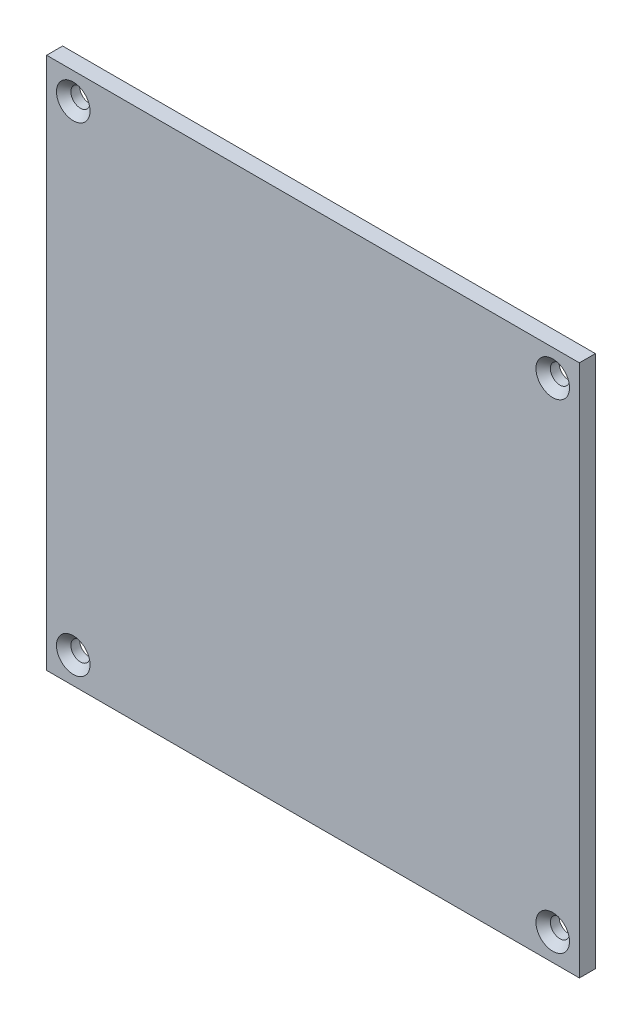
ISO-10303-21;
HEADER;
FILE_DESCRIPTION(('STEP AP214'),'2;1');
FILE_NAME('part.step','',(''),(''),'','','');
FILE_SCHEMA(('AUTOMOTIVE_DESIGN { 1 0 10303 214 1 1 1 1 }'));
ENDSEC;
DATA;
#1=APPLICATION_CONTEXT('core data for automotive mechanical design processes');
#2=APPLICATION_PROTOCOL_DEFINITION('international standard','automotive_design',2000,#1);
#3=PRODUCT_CONTEXT('',#1,'mechanical');
#4=PRODUCT('Part','Part','',(#3));
#5=PRODUCT_RELATED_PRODUCT_CATEGORY('part','',(#4));
#6=PRODUCT_DEFINITION_FORMATION('','',#4);
#7=PRODUCT_DEFINITION_CONTEXT('part definition',#1,'design');
#8=PRODUCT_DEFINITION('design','',#6,#7);
#9=PRODUCT_DEFINITION_SHAPE('','',#8);
#10=(LENGTH_UNIT() NAMED_UNIT(*) SI_UNIT(.MILLI.,.METRE.));
#11=(NAMED_UNIT(*) PLANE_ANGLE_UNIT() SI_UNIT($,.RADIAN.));
#12=(NAMED_UNIT(*) SI_UNIT($,.STERADIAN.) SOLID_ANGLE_UNIT());
#13=UNCERTAINTY_MEASURE_WITH_UNIT(LENGTH_MEASURE(1.E-05),#10,'distance_accuracy_value','');
#14=(GEOMETRIC_REPRESENTATION_CONTEXT(3) GLOBAL_UNCERTAINTY_ASSIGNED_CONTEXT((#13)) GLOBAL_UNIT_ASSIGNED_CONTEXT((#10,
#11,#12)) REPRESENTATION_CONTEXT('',''));
#15=CARTESIAN_POINT('',(0.,0.,0.));
#16=DIRECTION('',(0.,0.,1.));
#17=DIRECTION('',(1.,0.,0.));
#18=AXIS2_PLACEMENT_3D('',#15,#16,#17);
#19=CARTESIAN_POINT('',(0.,0.,3.));
#20=DIRECTION('',(1.,0.,0.));
#21=DIRECTION('',(0.,1.,0.));
#22=AXIS2_PLACEMENT_3D('',#19,#20,#21);
#23=PLANE('',#22);
#24=DIRECTION('',(0.,-1.,0.));
#25=VECTOR('',#24,1.);
#26=CARTESIAN_POINT('',(0.,0.,0.));
#27=LINE('',#26,#25);
#28=CARTESIAN_POINT('',(0.,100.,0.));
#29=VERTEX_POINT('',#28);
#30=CARTESIAN_POINT('',(0.,0.,0.));
#31=VERTEX_POINT('',#30);
#32=EDGE_CURVE('E98',#29,#31,#27,.T.);
#33=ORIENTED_EDGE('',*,*,#32,.T.);
#34=DIRECTION('',(0.,0.,-1.));
#35=VECTOR('',#34,1.);
#36=CARTESIAN_POINT('',(0.,0.,3.));
#37=LINE('',#36,#35);
#38=CARTESIAN_POINT('',(0.,0.,3.));
#39=VERTEX_POINT('',#38);
#40=EDGE_CURVE('E11',#39,#31,#37,.T.);
#41=ORIENTED_EDGE('',*,*,#40,.F.);
#42=DIRECTION('',(0.,-1.,0.));
#43=VECTOR('',#42,1.);
#44=CARTESIAN_POINT('',(0.,0.,3.));
#45=LINE('',#44,#43);
#46=CARTESIAN_POINT('',(0.,100.,3.));
#47=VERTEX_POINT('',#46);
#48=EDGE_CURVE('E86',#47,#39,#45,.T.);
#49=ORIENTED_EDGE('',*,*,#48,.F.);
#50=DIRECTION('',(0.,0.,-1.));
#51=VECTOR('',#50,1.);
#52=CARTESIAN_POINT('',(0.,100.,3.));
#53=LINE('',#52,#51);
#54=EDGE_CURVE('E94',#47,#29,#53,.T.);
#55=ORIENTED_EDGE('',*,*,#54,.T.);
#56=EDGE_LOOP('',(#33,#41,#49,#55));
#57=FACE_BOUND('',#56,.T.);
#58=ADVANCED_FACE('F35',(#57),#23,.F.);
#59=CARTESIAN_POINT('',(0.,0.,3.));
#60=DIRECTION('',(0.,1.,0.));
#61=DIRECTION('',(0.,0.,1.));
#62=AXIS2_PLACEMENT_3D('',#59,#60,#61);
#63=PLANE('',#62);
#64=DIRECTION('',(1.,0.,0.));
#65=VECTOR('',#64,1.);
#66=CARTESIAN_POINT('',(0.,0.,0.));
#67=LINE('',#66,#65);
#68=CARTESIAN_POINT('',(100.,0.,0.));
#69=VERTEX_POINT('',#68);
#70=EDGE_CURVE('E90',#31,#69,#67,.T.);
#71=ORIENTED_EDGE('',*,*,#70,.T.);
#72=DIRECTION('',(0.,0.,-1.));
#73=VECTOR('',#72,1.);
#74=CARTESIAN_POINT('',(100.,0.,3.));
#75=LINE('',#74,#73);
#76=CARTESIAN_POINT('',(100.,0.,3.));
#77=VERTEX_POINT('',#76);
#78=EDGE_CURVE('E43',#77,#69,#75,.T.);
#79=ORIENTED_EDGE('',*,*,#78,.F.);
#80=DIRECTION('',(1.,0.,0.));
#81=VECTOR('',#80,1.);
#82=CARTESIAN_POINT('',(0.,0.,3.));
#83=LINE('',#82,#81);
#84=EDGE_CURVE('E81',#39,#77,#83,.T.);
#85=ORIENTED_EDGE('',*,*,#84,.F.);
#86=ORIENTED_EDGE('',*,*,#40,.T.);
#87=EDGE_LOOP('',(#71,#79,#85,#86));
#88=FACE_BOUND('',#87,.T.);
#89=ADVANCED_FACE('F89',(#88),#63,.F.);
#90=CARTESIAN_POINT('',(100.,0.,3.));
#91=DIRECTION('',(-1.,0.,0.));
#92=DIRECTION('',(0.,-1.,0.));
#93=AXIS2_PLACEMENT_3D('',#90,#91,#92);
#94=PLANE('',#93);
#95=DIRECTION('',(0.,1.,0.));
#96=VECTOR('',#95,1.);
#97=CARTESIAN_POINT('',(100.,0.,0.));
#98=LINE('',#97,#96);
#99=CARTESIAN_POINT('',(100.,100.,0.));
#100=VERTEX_POINT('',#99);
#101=EDGE_CURVE('E68',#69,#100,#98,.T.);
#102=ORIENTED_EDGE('',*,*,#101,.T.);
#103=DIRECTION('',(0.,0.,-1.));
#104=VECTOR('',#103,1.);
#105=CARTESIAN_POINT('',(100.,100.,3.));
#106=LINE('',#105,#104);
#107=CARTESIAN_POINT('',(100.,100.,3.));
#108=VERTEX_POINT('',#107);
#109=EDGE_CURVE('E91',#108,#100,#106,.T.);
#110=ORIENTED_EDGE('',*,*,#109,.F.);
#111=DIRECTION('',(0.,1.,0.));
#112=VECTOR('',#111,1.);
#113=CARTESIAN_POINT('',(100.,0.,3.));
#114=LINE('',#113,#112);
#115=EDGE_CURVE('E84',#77,#108,#114,.T.);
#116=ORIENTED_EDGE('',*,*,#115,.F.);
#117=ORIENTED_EDGE('',*,*,#78,.T.);
#118=EDGE_LOOP('',(#102,#110,#116,#117));
#119=FACE_BOUND('',#118,.T.);
#120=ADVANCED_FACE('F92',(#119),#94,.F.);
#121=CARTESIAN_POINT('',(0.,100.,3.));
#122=DIRECTION('',(0.,-1.,0.));
#123=DIRECTION('',(0.,0.,-1.));
#124=AXIS2_PLACEMENT_3D('',#121,#122,#123);
#125=PLANE('',#124);
#126=DIRECTION('',(-1.,0.,0.));
#127=VECTOR('',#126,1.);
#128=CARTESIAN_POINT('',(0.,100.,0.));
#129=LINE('',#128,#127);
#130=EDGE_CURVE('E74',#100,#29,#129,.T.);
#131=ORIENTED_EDGE('',*,*,#130,.T.);
#132=ORIENTED_EDGE('',*,*,#54,.F.);
#133=DIRECTION('',(-1.,0.,0.));
#134=VECTOR('',#133,1.);
#135=CARTESIAN_POINT('',(0.,100.,3.));
#136=LINE('',#135,#134);
#137=EDGE_CURVE('E51',#108,#47,#136,.T.);
#138=ORIENTED_EDGE('',*,*,#137,.F.);
#139=ORIENTED_EDGE('',*,*,#109,.T.);
#140=EDGE_LOOP('',(#131,#132,#138,#139));
#141=FACE_BOUND('',#140,.T.);
#142=ADVANCED_FACE('F106',(#141),#125,.F.);
#143=CARTESIAN_POINT('',(0.,0.,3.));
#144=DIRECTION('',(0.,0.,-1.));
#145=DIRECTION('',(-1.,0.,0.));
#146=AXIS2_PLACEMENT_3D('',#143,#144,#145);
#147=PLANE('',#146);
#148=CARTESIAN_POINT('',(4.99999999999999,95.,3.));
#149=DIRECTION('',(0.,0.,1.));
#150=DIRECTION('',(1.,0.,0.));
#151=AXIS2_PLACEMENT_3D('',#148,#149,#150);
#152=CIRCLE('',#151,3.15);
#153=CARTESIAN_POINT('',(8.14999999999999,95.,3.));
#154=VERTEX_POINT('',#153);
#155=EDGE_CURVE('E144',#154,#154,#152,.T.);
#156=ORIENTED_EDGE('',*,*,#155,.F.);
#157=EDGE_LOOP('',(#156));
#158=FACE_BOUND('',#157,.T.);
#159=CARTESIAN_POINT('',(95.,95.,3.));
#160=DIRECTION('',(0.,0.,1.));
#161=DIRECTION('',(1.,0.,0.));
#162=AXIS2_PLACEMENT_3D('',#159,#160,#161);
#163=CIRCLE('',#162,3.15);
#164=CARTESIAN_POINT('',(98.15,95.,3.));
#165=VERTEX_POINT('',#164);
#166=EDGE_CURVE('E135',#165,#165,#163,.T.);
#167=ORIENTED_EDGE('',*,*,#166,.F.);
#168=EDGE_LOOP('',(#167));
#169=FACE_BOUND('',#168,.T.);
#170=CARTESIAN_POINT('',(95.,5.,3.));
#171=DIRECTION('',(0.,0.,1.));
#172=DIRECTION('',(1.,0.,0.));
#173=AXIS2_PLACEMENT_3D('',#170,#171,#172);
#174=CIRCLE('',#173,3.15);
#175=CARTESIAN_POINT('',(98.15,5.,3.));
#176=VERTEX_POINT('',#175);
#177=EDGE_CURVE('E126',#176,#176,#174,.T.);
#178=ORIENTED_EDGE('',*,*,#177,.F.);
#179=EDGE_LOOP('',(#178));
#180=FACE_BOUND('',#179,.T.);
#181=CARTESIAN_POINT('',(4.99999999999999,5.,3.));
#182=DIRECTION('',(0.,0.,1.));
#183=DIRECTION('',(1.,0.,0.));
#184=AXIS2_PLACEMENT_3D('',#181,#182,#183);
#185=CIRCLE('',#184,3.15);
#186=CARTESIAN_POINT('',(8.14999999999999,5.,3.));
#187=VERTEX_POINT('',#186);
#188=EDGE_CURVE('E117',#187,#187,#185,.T.);
#189=ORIENTED_EDGE('',*,*,#188,.F.);
#190=EDGE_LOOP('',(#189));
#191=FACE_BOUND('',#190,.T.);
#192=ORIENTED_EDGE('',*,*,#48,.T.);
#193=ORIENTED_EDGE('',*,*,#84,.T.);
#194=ORIENTED_EDGE('',*,*,#115,.T.);
#195=ORIENTED_EDGE('',*,*,#137,.T.);
#196=EDGE_LOOP('',(#192,#193,#194,#195));
#197=FACE_BOUND('',#196,.T.);
#198=ADVANCED_FACE('F82',(#158,#169,#180,#191,#197),#147,.F.);
#199=CARTESIAN_POINT('',(0.,0.,0.));
#200=DIRECTION('',(0.,0.,-1.));
#201=DIRECTION('',(-1.,0.,0.));
#202=AXIS2_PLACEMENT_3D('',#199,#200,#201);
#203=PLANE('',#202);
#204=CARTESIAN_POINT('',(4.99999999999999,95.,0.));
#205=DIRECTION('',(0.,0.,1.));
#206=DIRECTION('',(1.,0.,0.));
#207=AXIS2_PLACEMENT_3D('',#204,#205,#206);
#208=CIRCLE('',#207,1.8);
#209=CARTESIAN_POINT('',(6.79999999999999,95.,0.));
#210=VERTEX_POINT('',#209);
#211=EDGE_CURVE('E138',#210,#210,#208,.T.);
#212=ORIENTED_EDGE('',*,*,#211,.T.);
#213=EDGE_LOOP('',(#212));
#214=FACE_BOUND('',#213,.T.);
#215=CARTESIAN_POINT('',(95.,95.,0.));
#216=DIRECTION('',(0.,0.,1.));
#217=DIRECTION('',(1.,0.,0.));
#218=AXIS2_PLACEMENT_3D('',#215,#216,#217);
#219=CIRCLE('',#218,1.8);
#220=CARTESIAN_POINT('',(96.8,95.,0.));
#221=VERTEX_POINT('',#220);
#222=EDGE_CURVE('E129',#221,#221,#219,.T.);
#223=ORIENTED_EDGE('',*,*,#222,.T.);
#224=EDGE_LOOP('',(#223));
#225=FACE_BOUND('',#224,.T.);
#226=CARTESIAN_POINT('',(95.,5.,0.));
#227=DIRECTION('',(0.,0.,1.));
#228=DIRECTION('',(1.,0.,0.));
#229=AXIS2_PLACEMENT_3D('',#226,#227,#228);
#230=CIRCLE('',#229,1.8);
#231=CARTESIAN_POINT('',(96.8,5.,0.));
#232=VERTEX_POINT('',#231);
#233=EDGE_CURVE('E120',#232,#232,#230,.T.);
#234=ORIENTED_EDGE('',*,*,#233,.T.);
#235=EDGE_LOOP('',(#234));
#236=FACE_BOUND('',#235,.T.);
#237=CARTESIAN_POINT('',(4.99999999999999,5.,0.));
#238=DIRECTION('',(0.,0.,1.));
#239=DIRECTION('',(1.,0.,0.));
#240=AXIS2_PLACEMENT_3D('',#237,#238,#239);
#241=CIRCLE('',#240,1.8);
#242=CARTESIAN_POINT('',(6.79999999999999,5.,0.));
#243=VERTEX_POINT('',#242);
#244=EDGE_CURVE('E101',#243,#243,#241,.T.);
#245=ORIENTED_EDGE('',*,*,#244,.T.);
#246=EDGE_LOOP('',(#245));
#247=FACE_BOUND('',#246,.T.);
#248=ORIENTED_EDGE('',*,*,#32,.F.);
#249=ORIENTED_EDGE('',*,*,#130,.F.);
#250=ORIENTED_EDGE('',*,*,#101,.F.);
#251=ORIENTED_EDGE('',*,*,#70,.F.);
#252=EDGE_LOOP('',(#248,#249,#250,#251));
#253=FACE_BOUND('',#252,.T.);
#254=ADVANCED_FACE('F109',(#214,#225,#236,#247,#253),#203,.T.);
#255=CARTESIAN_POINT('',(4.99999999999999,5.,3.));
#256=DIRECTION('',(0.,0.,1.));
#257=DIRECTION('',(1.,0.,0.));
#258=AXIS2_PLACEMENT_3D('',#255,#256,#257);
#259=CYLINDRICAL_SURFACE('',#258,1.8);
#260=ORIENTED_EDGE('',*,*,#244,.F.);
#261=EDGE_LOOP('',(#260));
#262=FACE_BOUND('',#261,.T.);
#263=CARTESIAN_POINT('',(4.99999999999999,5.,1.65));
#264=DIRECTION('',(0.,0.,1.));
#265=DIRECTION('',(1.,0.,0.));
#266=AXIS2_PLACEMENT_3D('',#263,#264,#265);
#267=CIRCLE('',#266,1.8);
#268=CARTESIAN_POINT('',(6.79999999999999,5.,1.65));
#269=VERTEX_POINT('',#268);
#270=EDGE_CURVE('E114',#269,#269,#267,.T.);
#271=ORIENTED_EDGE('',*,*,#270,.T.);
#272=EDGE_LOOP('',(#271));
#273=FACE_BOUND('',#272,.T.);
#274=ADVANCED_FACE('F162',(#262,#273),#259,.F.);
#275=CARTESIAN_POINT('',(4.99999999999999,5.,3.));
#276=DIRECTION('',(0.,0.,1.));
#277=DIRECTION('',(1.,0.,0.));
#278=AXIS2_PLACEMENT_3D('',#275,#276,#277);
#279=CONICAL_SURFACE('',#278,3.15,0.785398163397449);
#280=ORIENTED_EDGE('',*,*,#270,.F.);
#281=EDGE_LOOP('',(#280));
#282=FACE_BOUND('',#281,.T.);
#283=ORIENTED_EDGE('',*,*,#188,.T.);
#284=EDGE_LOOP('',(#283));
#285=FACE_BOUND('',#284,.T.);
#286=ADVANCED_FACE('F159',(#282,#285),#279,.F.);
#287=CARTESIAN_POINT('',(95.,5.,3.));
#288=DIRECTION('',(0.,0.,1.));
#289=DIRECTION('',(1.,0.,0.));
#290=AXIS2_PLACEMENT_3D('',#287,#288,#289);
#291=CYLINDRICAL_SURFACE('',#290,1.8);
#292=ORIENTED_EDGE('',*,*,#233,.F.);
#293=EDGE_LOOP('',(#292));
#294=FACE_BOUND('',#293,.T.);
#295=CARTESIAN_POINT('',(95.,5.,1.65));
#296=DIRECTION('',(0.,0.,1.));
#297=DIRECTION('',(1.,0.,0.));
#298=AXIS2_PLACEMENT_3D('',#295,#296,#297);
#299=CIRCLE('',#298,1.8);
#300=CARTESIAN_POINT('',(96.8,5.,1.65));
#301=VERTEX_POINT('',#300);
#302=EDGE_CURVE('E123',#301,#301,#299,.T.);
#303=ORIENTED_EDGE('',*,*,#302,.T.);
#304=EDGE_LOOP('',(#303));
#305=FACE_BOUND('',#304,.T.);
#306=ADVANCED_FACE('F161',(#294,#305),#291,.F.);
#307=CARTESIAN_POINT('',(95.,5.,3.));
#308=DIRECTION('',(0.,0.,1.));
#309=DIRECTION('',(1.,0.,0.));
#310=AXIS2_PLACEMENT_3D('',#307,#308,#309);
#311=CONICAL_SURFACE('',#310,3.15,0.78539816339745);
#312=ORIENTED_EDGE('',*,*,#302,.F.);
#313=EDGE_LOOP('',(#312));
#314=FACE_BOUND('',#313,.T.);
#315=ORIENTED_EDGE('',*,*,#177,.T.);
#316=EDGE_LOOP('',(#315));
#317=FACE_BOUND('',#316,.T.);
#318=ADVANCED_FACE('F169',(#314,#317),#311,.F.);
#319=CARTESIAN_POINT('',(95.,95.,3.));
#320=DIRECTION('',(0.,0.,1.));
#321=DIRECTION('',(1.,0.,0.));
#322=AXIS2_PLACEMENT_3D('',#319,#320,#321);
#323=CYLINDRICAL_SURFACE('',#322,1.8);
#324=ORIENTED_EDGE('',*,*,#222,.F.);
#325=EDGE_LOOP('',(#324));
#326=FACE_BOUND('',#325,.T.);
#327=CARTESIAN_POINT('',(95.,95.,1.65));
#328=DIRECTION('',(0.,0.,1.));
#329=DIRECTION('',(1.,0.,0.));
#330=AXIS2_PLACEMENT_3D('',#327,#328,#329);
#331=CIRCLE('',#330,1.8);
#332=CARTESIAN_POINT('',(96.8,95.,1.65));
#333=VERTEX_POINT('',#332);
#334=EDGE_CURVE('E132',#333,#333,#331,.T.);
#335=ORIENTED_EDGE('',*,*,#334,.T.);
#336=EDGE_LOOP('',(#335));
#337=FACE_BOUND('',#336,.T.);
#338=ADVANCED_FACE('F203',(#326,#337),#323,.F.);
#339=CARTESIAN_POINT('',(95.,95.,3.));
#340=DIRECTION('',(0.,0.,1.));
#341=DIRECTION('',(1.,0.,0.));
#342=AXIS2_PLACEMENT_3D('',#339,#340,#341);
#343=CONICAL_SURFACE('',#342,3.15,0.78539816339745);
#344=ORIENTED_EDGE('',*,*,#334,.F.);
#345=EDGE_LOOP('',(#344));
#346=FACE_BOUND('',#345,.T.);
#347=ORIENTED_EDGE('',*,*,#166,.T.);
#348=EDGE_LOOP('',(#347));
#349=FACE_BOUND('',#348,.T.);
#350=ADVANCED_FACE('F208',(#346,#349),#343,.F.);
#351=CARTESIAN_POINT('',(4.99999999999999,95.,3.));
#352=DIRECTION('',(0.,0.,1.));
#353=DIRECTION('',(1.,0.,0.));
#354=AXIS2_PLACEMENT_3D('',#351,#352,#353);
#355=CYLINDRICAL_SURFACE('',#354,1.8);
#356=ORIENTED_EDGE('',*,*,#211,.F.);
#357=EDGE_LOOP('',(#356));
#358=FACE_BOUND('',#357,.T.);
#359=CARTESIAN_POINT('',(4.99999999999999,95.,1.65));
#360=DIRECTION('',(0.,0.,1.));
#361=DIRECTION('',(1.,0.,0.));
#362=AXIS2_PLACEMENT_3D('',#359,#360,#361);
#363=CIRCLE('',#362,1.8);
#364=CARTESIAN_POINT('',(6.79999999999999,95.,1.65));
#365=VERTEX_POINT('',#364);
#366=EDGE_CURVE('E141',#365,#365,#363,.T.);
#367=ORIENTED_EDGE('',*,*,#366,.T.);
#368=EDGE_LOOP('',(#367));
#369=FACE_BOUND('',#368,.T.);
#370=ADVANCED_FACE('F214',(#358,#369),#355,.F.);
#371=CARTESIAN_POINT('',(4.99999999999999,95.,3.));
#372=DIRECTION('',(0.,0.,1.));
#373=DIRECTION('',(1.,0.,0.));
#374=AXIS2_PLACEMENT_3D('',#371,#372,#373);
#375=CONICAL_SURFACE('',#374,3.15,0.785398163397449);
#376=ORIENTED_EDGE('',*,*,#366,.F.);
#377=EDGE_LOOP('',(#376));
#378=FACE_BOUND('',#377,.T.);
#379=ORIENTED_EDGE('',*,*,#155,.T.);
#380=EDGE_LOOP('',(#379));
#381=FACE_BOUND('',#380,.T.);
#382=ADVANCED_FACE('F148',(#378,#381),#375,.F.);
#383=CLOSED_SHELL('',(#58,#89,#120,#142,#198,#254,#274,#286,#306,#318,#338,#350,#370,#382));
#384=MANIFOLD_SOLID_BREP('B2',#383);
#385=ADVANCED_BREP_SHAPE_REPRESENTATION('',(#18,#384),#14);
#386=SHAPE_DEFINITION_REPRESENTATION(#9,#385);
ENDSEC;
END-ISO-10303-21;
